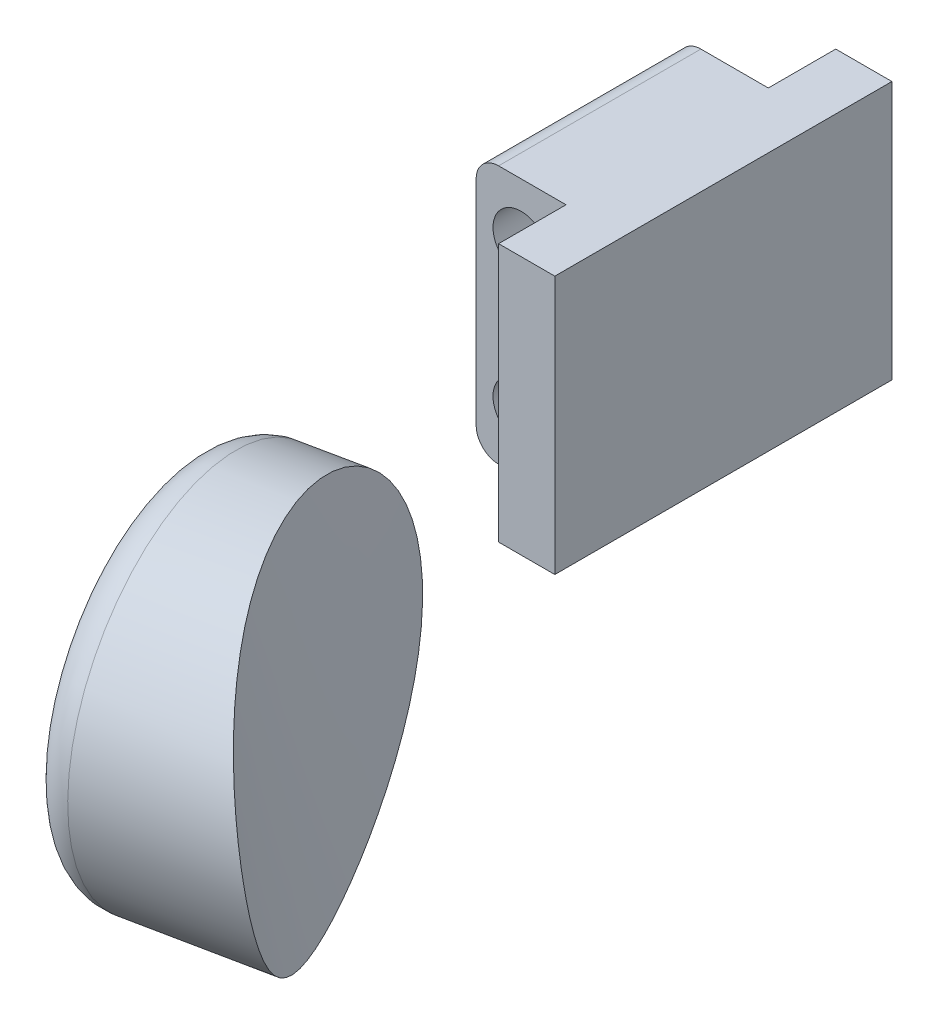
ISO-10303-21;
HEADER;
FILE_DESCRIPTION(('STEP AP214'),'2;1');
FILE_NAME('part.step','',(''),(''),'','','');
FILE_SCHEMA(('AUTOMOTIVE_DESIGN { 1 0 10303 214 1 1 1 1 }'));
ENDSEC;
DATA;
#1=APPLICATION_CONTEXT('core data for automotive mechanical design processes');
#2=APPLICATION_PROTOCOL_DEFINITION('international standard','automotive_design',2000,#1);
#3=PRODUCT_CONTEXT('',#1,'mechanical');
#4=PRODUCT('Part','Part','',(#3));
#5=PRODUCT_RELATED_PRODUCT_CATEGORY('part','',(#4));
#6=PRODUCT_DEFINITION_FORMATION('','',#4);
#7=PRODUCT_DEFINITION_CONTEXT('part definition',#1,'design');
#8=PRODUCT_DEFINITION('design','',#6,#7);
#9=PRODUCT_DEFINITION_SHAPE('','',#8);
#10=(LENGTH_UNIT() NAMED_UNIT(*) SI_UNIT(.MILLI.,.METRE.));
#11=(NAMED_UNIT(*) PLANE_ANGLE_UNIT() SI_UNIT($,.RADIAN.));
#12=(NAMED_UNIT(*) SI_UNIT($,.STERADIAN.) SOLID_ANGLE_UNIT());
#13=UNCERTAINTY_MEASURE_WITH_UNIT(LENGTH_MEASURE(1.E-05),#10,'distance_accuracy_value','');
#14=(GEOMETRIC_REPRESENTATION_CONTEXT(3) GLOBAL_UNCERTAINTY_ASSIGNED_CONTEXT((#13)) GLOBAL_UNIT_ASSIGNED_CONTEXT((#10,
#11,#12)) REPRESENTATION_CONTEXT('',''));
#15=CARTESIAN_POINT('',(0.,0.,0.));
#16=DIRECTION('',(0.,0.,1.));
#17=DIRECTION('',(1.,0.,0.));
#18=AXIS2_PLACEMENT_3D('',#15,#16,#17);
#19=CARTESIAN_POINT('',(47.9236738342779,0.,-110.329320506319));
#20=CARTESIAN_POINT('',(47.9236738342779,17.6991075048238,-110.329320506319));
#21=CARTESIAN_POINT('',(42.56332147204,34.8495537524119,-110.016211732728));
#22=CARTESIAN_POINT('',(37.202969109802,52.,-109.703102959137));
#23=CARTESIAN_POINT('',(48.4009958835601,0.,-111.031038484072));
#24=CARTESIAN_POINT('',(48.4009958835601,17.7056926320765,-111.031038484072));
#25=CARTESIAN_POINT('',(42.988769661527,34.8528463160383,-110.763685740666));
#26=CARTESIAN_POINT('',(37.5765434394938,52.,-110.496332997261));
#27=CARTESIAN_POINT('',(49.2975419279811,0.,-112.476546047765));
#28=CARTESIAN_POINT('',(49.2975419279811,17.7184400600976,-112.476546047765));
#29=CARTESIAN_POINT('',(43.7883921713864,34.8592200300488,-112.298305642809));
#30=CARTESIAN_POINT('',(38.2792424147916,52.,-112.120065237854));
#31=CARTESIAN_POINT('',(50.4692614141899,0.,-114.758087054483));
#32=CARTESIAN_POINT('',(50.4692614141899,17.7355814268284,-114.758087054483));
#33=CARTESIAN_POINT('',(44.8350102827149,34.8677907134142,-114.706065238378));
#34=CARTESIAN_POINT('',(39.20075915124,52.,-114.654043422274));
#35=CARTESIAN_POINT('',(51.4690759019835,0.,-117.139972558996));
#36=CARTESIAN_POINT('',(51.4690759019835,17.7505041490611,-117.139972558996));
#37=CARTESIAN_POINT('',(45.7298186944661,34.8752520745306,-117.206468659858));
#38=CARTESIAN_POINT('',(39.9905614869487,52.,-117.272964760719));
#39=CARTESIAN_POINT('',(56.4437003302975,0.,-131.955741592532));
#40=CARTESIAN_POINT('',(56.4437003302975,17.8284818993206,-131.955741592532));
#41=CARTESIAN_POINT('',(50.1938466908073,34.9142409496603,-132.685636645527));
#42=CARTESIAN_POINT('',(43.943993051317,52.,-133.415531698523));
#43=CARTESIAN_POINT('',(52.9769440445301,0.,-149.535584917485));
#44=CARTESIAN_POINT('',(52.9769440445301,17.7081403198643,-149.535584917485));
#45=CARTESIAN_POINT('',(47.1946128262273,34.8540701599321,-150.49695185142));
#46=CARTESIAN_POINT('',(41.4122816079244,52.,-151.458318785355));
#47=CARTESIAN_POINT('',(31.1969356532968,0.,-174.044597889101));
#48=CARTESIAN_POINT('',(31.1969356532968,17.4906090614254,-174.044597889101));
#49=CARTESIAN_POINT('',(28.0078512048271,34.7453045307127,-174.323574782565));
#50=CARTESIAN_POINT('',(24.8187667563575,52.,-174.602551676028));
#51=CARTESIAN_POINT('',(13.622767151366,0.,-173.705039048735));
#52=CARTESIAN_POINT('',(13.622767151366,17.395667899342,-173.705039048735));
#53=CARTESIAN_POINT('',(12.4456423177,34.697833949671,-172.933268426039));
#54=CARTESIAN_POINT('',(11.268517484034,52.,-172.161497803343));
#55=CARTESIAN_POINT('',(-5.47011481992174,0.,-145.636319938627));
#56=CARTESIAN_POINT('',(-5.47011481992174,17.3443852822835,-145.636319938627));
#57=CARTESIAN_POINT('',(-4.57228526177984,34.6721926411418,-143.034308108505));
#58=CARTESIAN_POINT('',(-3.67445570363794,52.,-140.432296278383));
#59=CARTESIAN_POINT('',(-3.39694497688932,0.,-123.187638746028));
#60=CARTESIAN_POINT('',(-3.39694497688932,17.3880438273085,-123.187638746028));
#61=CARTESIAN_POINT('',(-2.82647522860501,34.6940219136543,-120.150450696485));
#62=CARTESIAN_POINT('',(-2.25600548032069,52.,-117.113262646942));
#63=CARTESIAN_POINT('',(18.383063414344,0.,-98.6786257744115));
#64=CARTESIAN_POINT('',(18.383063414344,17.4695693050474,-98.6786257744115));
#65=CARTESIAN_POINT('',(16.3602863927951,34.7347846525237,-96.3238277653402));
#66=CARTESIAN_POINT('',(14.3375093712462,52.,-93.9690297562689));
#67=CARTESIAN_POINT('',(32.3904987881623,0.,-96.5947856718746));
#68=CARTESIAN_POINT('',(32.3904987881623,17.5091781505084,-96.5947856718746));
#69=CARTESIAN_POINT('',(28.7546714780627,34.7545890752542,-95.0189439220586));
#70=CARTESIAN_POINT('',(25.1188441679631,52.,-93.4431021722425));
#71=CARTESIAN_POINT('',(43.1464787762488,0.,-104.904803382329));
#72=CARTESIAN_POINT('',(43.1464787762488,17.6370277607948,-104.904803382329));
#73=CARTESIAN_POINT('',(38.3116952612447,34.8185138803974,-104.17349639431));
#74=CARTESIAN_POINT('',(33.4769117462406,52.,-103.442189406291));
#75=CARTESIAN_POINT('',(44.8491054504042,0.,-106.495815316789));
#76=CARTESIAN_POINT('',(44.8491054504042,17.6580610456385,-106.495815316789));
#77=CARTESIAN_POINT('',(39.8256352014193,34.8290305228193,-105.90504607363));
#78=CARTESIAN_POINT('',(34.8021649524344,52.,-105.314276830471));
#79=CARTESIAN_POINT('',(46.4515690488499,0.,-108.292640576634));
#80=CARTESIAN_POINT('',(46.4515690488499,17.6789292965815,-108.292640576634));
#81=CARTESIAN_POINT('',(41.2517106780921,34.8394646482907,-107.841585577924));
#82=CARTESIAN_POINT('',(36.0518523073342,52.,-107.390530579214));
#83=CARTESIAN_POINT('',(47.4463517849958,0.,-109.627602528566));
#84=CARTESIAN_POINT('',(47.4463517849958,17.6925223775711,-109.627602528566));
#85=CARTESIAN_POINT('',(42.137873282553,34.8462611887856,-109.26873772479));
#86=CARTESIAN_POINT('',(36.8293947801102,52.,-108.909872921013));
#87=CARTESIAN_POINT('',(47.9236738342779,0.,-110.329320506319));
#88=CARTESIAN_POINT('',(47.9236738342779,17.6991075048238,-110.329320506319));
#89=CARTESIAN_POINT('',(42.56332147204,34.8495537524119,-110.016211732728));
#90=CARTESIAN_POINT('',(37.202969109802,52.,-109.703102959137));
#91=B_SPLINE_SURFACE_WITH_KNOTS('',3,3,((#19,#20,#21,#22),(#23,#24,#25,#26),(#27,#28,#29,#30),
(#31,#32,#33,#34),(#35,#36,#37,#38),(#39,#40,#41,#42),(#43,#44,#45,#46),(#47,#48,#49,#50),(#51,
#52,#53,#54),(#55,#56,#57,#58),(#59,#60,#61,#62),(#63,#64,#65,#66),(#67,#68,#69,#70),(#71,#72,
#73,#74),(#75,#76,#77,#78),(#79,#80,#81,#82),(#83,#84,#85,#86),(#87,#88,#89,#90)),.UNSPECIFIED.,
.T.,.F.,.F.,(4,1,1,1,1,2,2,2,1,1,1,1,4),(4,4),(0.,0.0125,0.0249999999999999,0.0375000000000001,
0.05,0.25,0.5,0.75,0.95,0.9625,0.975,0.9875,1.),(0.,1.),.UNSPECIFIED.);
#92=CARTESIAN_POINT('',(7.21185150487884,40.9148197263255,-106.328511216655));
#93=CARTESIAN_POINT('',(7.18159766582376,41.1394840780572,-106.322098490295));
#94=CARTESIAN_POINT('',(7.14521295501741,41.3635358712388,-106.324049374362));
#95=CARTESIAN_POINT('',(7.06108371256741,41.8088194014787,-106.344451702724));
#96=CARTESIAN_POINT('',(7.01333476968595,42.0300500082197,-106.362909562198));
#97=CARTESIAN_POINT('',(6.90748604572067,42.4683671042778,-106.416032103339));
#98=CARTESIAN_POINT('',(6.84937141265366,42.6854471458817,-106.450720156975));
#99=CARTESIAN_POINT('',(6.72398291802274,43.1138682639204,-106.535911282031));
#100=CARTESIAN_POINT('',(6.65670519493354,43.3252068755108,-106.586421032785));
#101=CARTESIAN_POINT('',(6.51457468099788,43.7398030905078,-106.702499273606));
#102=CARTESIAN_POINT('',(6.43976177426315,43.9430960515556,-106.767990590618));
#103=CARTESIAN_POINT('',(6.28343422524179,44.3417363017902,-106.913727722762));
#104=CARTESIAN_POINT('',(6.2019173071237,44.5370808587889,-106.993978559879));
#105=CARTESIAN_POINT('',(6.03338505635752,44.9187091982539,-107.168708639347));
#106=CARTESIAN_POINT('',(5.94637201007548,45.1049966920853,-107.263181987527));
#107=CARTESIAN_POINT('',(5.76791234831125,45.4676951838759,-107.465899291758));
#108=CARTESIAN_POINT('',(5.67646555923655,45.6441057945458,-107.574143787256));
#109=CARTESIAN_POINT('',(5.4835589292109,45.9983294244821,-107.812070994307));
#110=CARTESIAN_POINT('',(5.38184929395204,46.1753515439442,-107.942730462337));
#111=CARTESIAN_POINT('',(5.17578395103564,46.5159287486816,-108.218567549995));
#112=CARTESIAN_POINT('',(5.07142904790165,46.6794878657749,-108.363740794071));
#113=CARTESIAN_POINT('',(4.86111700110517,46.9922197815614,-108.667994735137));
#114=CARTESIAN_POINT('',(4.75515898295474,47.1413843748863,-108.827083266966));
#115=CARTESIAN_POINT('',(4.54280818540879,47.4240845699208,-109.158192854924));
#116=CARTESIAN_POINT('',(4.43641559385283,47.5576263091442,-109.330208788546));
#117=CARTESIAN_POINT('',(4.22238233280157,47.8101586541145,-109.689224111277));
#118=CARTESIAN_POINT('',(4.11475031697206,47.928870462082,-109.876425044792));
#119=CARTESIAN_POINT('',(3.90098909589054,48.148000127717,-110.262071861389));
#120=CARTESIAN_POINT('',(3.79485992127357,48.2484176129532,-110.46051797329));
#121=CARTESIAN_POINT('',(3.58501712411785,48.4298924350363,-110.867238392324));
#122=CARTESIAN_POINT('',(3.481302964922,48.5109541108476,-111.075510484221));
#123=CARTESIAN_POINT('',(3.27706709399762,48.6527976570626,-111.50036013317));
#124=CARTESIAN_POINT('',(3.1765452201647,48.713580558718,-111.716937267255));
#125=CARTESIAN_POINT('',(2.98396106021225,48.8117362744746,-112.146467054879));
#126=CARTESIAN_POINT('',(2.89172259207167,48.8500628674693,-112.359123070613));
#127=CARTESIAN_POINT('',(2.71130389115271,48.9069923795967,-112.788755543091));
#128=CARTESIAN_POINT('',(2.6231235490554,48.9255958303348,-113.005731883227));
#129=CARTESIAN_POINT('',(2.45126898590752,48.942696977062,-113.442198450711));
#130=CARTESIAN_POINT('',(2.36759386286284,48.9411987127754,-113.661688164103));
#131=CARTESIAN_POINT('',(2.20507159021938,48.9179135415687,-114.101377415488));
#132=CARTESIAN_POINT('',(2.1262243086515,48.8961271894877,-114.321576933905));
#133=CARTESIAN_POINT('',(1.97690118302046,48.8336530053845,-114.751315949565));
#134=CARTESIAN_POINT('',(1.9062109817459,48.7938205056688,-114.960905765588));
#135=CARTESIAN_POINT('',(1.7696287461449,48.6957667538057,-115.377331606102));
#136=CARTESIAN_POINT('',(1.70373668683436,48.6375455974172,-115.584167644927));
#137=CARTESIAN_POINT('',(1.57684339864153,48.5030637169281,-115.993408129456));
#138=CARTESIAN_POINT('',(1.51584179675335,48.4268043703958,-116.195812912283));
#139=CARTESIAN_POINT('',(1.39875586042136,48.2567447574413,-116.594586391871));
#140=CARTESIAN_POINT('',(1.34267152963564,48.16294447797,-116.790955084142));
#141=CARTESIAN_POINT('',(1.23608971435459,47.9597512241216,-117.173644150685));
#142=CARTESIAN_POINT('',(1.18553039016869,47.8505711149656,-117.360060384291));
#143=CARTESIAN_POINT('',(1.08913368376861,47.616460501666,-117.724106364385));
#144=CARTESIAN_POINT('',(1.04329791925988,47.4915246339145,-117.901733089922));
#145=CARTESIAN_POINT('',(0.956310047746273,47.226827951886,-118.246743424654));
#146=CARTESIAN_POINT('',(0.915157145042318,47.0870696640148,-118.414128771796));
#147=CARTESIAN_POINT('',(0.837447059716074,46.7936870843228,-118.737426345348));
#148=CARTESIAN_POINT('',(0.800889980885949,46.6400624794795,-118.893338312611));
#149=CARTESIAN_POINT('',(0.732112327912179,46.3191908611478,-119.193297161638));
#150=CARTESIAN_POINT('',(0.699915341610082,46.1518770389412,-119.337277987515));
#151=CARTESIAN_POINT('',(0.640005535256855,45.80550463843,-119.611385875167));
#152=CARTESIAN_POINT('',(0.612292825765799,45.6264457707037,-119.741512595341));
#153=CARTESIAN_POINT('',(0.561291004219272,45.2578751790944,-119.986922920323));
#154=CARTESIAN_POINT('',(0.538001204692819,45.0683650856068,-120.102208831001));
#155=CARTESIAN_POINT('',(0.495785694403577,44.680129112155,-120.31715039575));
#156=CARTESIAN_POINT('',(0.476861497510898,44.4814000639196,-120.416800623981));
#157=CARTESIAN_POINT('',(0.44326067531788,44.0749282268681,-120.600261490692));
#158=CARTESIAN_POINT('',(0.428610958208635,43.8671374175906,-120.683970680555));
#159=CARTESIAN_POINT('',(0.403719832848324,43.4451630271007,-120.834175012278));
#160=CARTESIAN_POINT('',(0.393478533918747,43.2309792874951,-120.900669727231));
#161=CARTESIAN_POINT('',(0.377438684848652,42.7977387858472,-121.01596899963));
#162=CARTESIAN_POINT('',(0.371640146503185,42.5786820108692,-121.06477351011));
#163=CARTESIAN_POINT('',(0.364550809362959,42.1372464832141,-121.144356779448));
#164=CARTESIAN_POINT('',(0.363260012925605,41.9148677287999,-121.175135528879));
#165=CARTESIAN_POINT('',(0.365283922777813,41.4677925158672,-121.218528392349));
#166=CARTESIAN_POINT('',(0.368610387006718,41.2430915918064,-121.231095964525));
#167=CARTESIAN_POINT('',(0.380013681269523,40.7935383964289,-121.237866491806));
#168=CARTESIAN_POINT('',(0.388090414782893,40.5686861282801,-121.232069820043));
#169=CARTESIAN_POINT('',(0.409144342498229,40.1203862046992,-121.202203685192));
#170=CARTESIAN_POINT('',(0.422122463605,39.896938823077,-121.178130765));
#171=CARTESIAN_POINT('',(0.453140354368962,39.4531646330737,-121.11195853321));
#172=CARTESIAN_POINT('',(0.471178371939654,39.2328367721911,-121.069865458787));
#173=CARTESIAN_POINT('',(0.512507644406426,38.7966702188892,-120.96800682724));
#174=CARTESIAN_POINT('',(0.535801958554398,38.5808342210326,-120.908230972117));
#175=CARTESIAN_POINT('',(0.587817542149199,38.1553358006892,-120.771542871778));
#176=CARTESIAN_POINT('',(0.616538687187694,37.9456732368057,-120.694631019392));
#177=CARTESIAN_POINT('',(0.679580734117951,37.5340196632984,-120.524334348715));
#178=CARTESIAN_POINT('',(0.713901644894774,37.3320286658476,-120.430949504286));
#179=CARTESIAN_POINT('',(0.788295919964925,36.9371696489458,-120.228507582912));
#180=CARTESIAN_POINT('',(0.828369184469298,36.7443014713139,-120.119450777837));
#181=CARTESIAN_POINT('',(0.914345209538068,36.3692626963408,-119.886715374541));
#182=CARTESIAN_POINT('',(0.960241715304225,36.1870809232101,-119.763052474568));
#183=CARTESIAN_POINT('',(1.05795889836239,35.8345483359039,-119.502104922992));
#184=CARTESIAN_POINT('',(1.10977738297771,35.6641931801095,-119.364825315592));
#185=CARTESIAN_POINT('',(1.21938544408859,35.3364078932229,-119.077737928872));
#186=CARTESIAN_POINT('',(1.27717589120818,35.1789796527048,-118.92792832347));
#187=CARTESIAN_POINT('',(1.39868250082053,34.8781565063673,-118.617047224767));
#188=CARTESIAN_POINT('',(1.46239866444907,34.7347616032377,-118.455975729307));
#189=CARTESIAN_POINT('',(1.59564013257972,34.4629701677062,-118.123910399756));
#190=CARTESIAN_POINT('',(1.66516504353947,34.3345726206454,-117.952917238097));
#191=CARTESIAN_POINT('',(1.80983634248144,34.0935849146329,-117.602387082178));
#192=CARTESIAN_POINT('',(1.8849827182199,33.9809947212539,-117.422850106527));
#193=CARTESIAN_POINT('',(2.04062427620696,33.7722967029369,-117.056655719395));
#194=CARTESIAN_POINT('',(2.12111953026495,33.6761890993419,-116.869998212334));
#195=CARTESIAN_POINT('',(2.28710087385352,33.5009875772022,-116.491006120471));
#196=CARTESIAN_POINT('',(2.37258701461614,33.4218938333459,-116.298671477403));
#197=CARTESIAN_POINT('',(2.54915204773214,33.2802708536861,-115.907454067515));
#198=CARTESIAN_POINT('',(2.64028523630396,33.2179491497833,-115.708520698883));
#199=CARTESIAN_POINT('',(2.82667500846588,33.1113750697448,-115.307771309929));
#200=CARTESIAN_POINT('',(2.92193161412244,33.0671227903208,-115.105955274185));
#201=CARTESIAN_POINT('',(3.11594947893285,32.996809357844,-114.700864485605));
#202=CARTESIAN_POINT('',(3.21471052433064,32.9707470972741,-114.497589822342));
#203=CARTESIAN_POINT('',(3.41509632433433,32.9368028001907,-114.09084511517));
#204=CARTESIAN_POINT('',(3.5167221470888,32.9289276380763,-113.887375026456));
#205=CARTESIAN_POINT('',(3.72517891314839,32.9313115083724,-113.475421523301));
#206=CARTESIAN_POINT('',(3.83207416472888,32.9421292675786,-113.266973809644));
#207=CARTESIAN_POINT('',(4.04722728436911,32.9827826357574,-112.852557548362));
#208=CARTESIAN_POINT('',(4.15548565267567,33.0126254386264,-112.646589968573));
#209=CARTESIAN_POINT('',(4.37235544487943,33.0910453077315,-112.238492161327));
#210=CARTESIAN_POINT('',(4.48096680234064,33.1396190305682,-112.036361255789));
#211=CARTESIAN_POINT('',(4.69759647706621,33.2551828914548,-111.636981175655));
#212=CARTESIAN_POINT('',(4.8056144933393,33.3221816287557,-111.439734327497));
#213=CARTESIAN_POINT('',(5.02337325450148,33.4766352399003,-111.045091853433));
#214=CARTESIAN_POINT('',(5.13305784820619,33.5646781777441,-110.847895052023));
#215=CARTESIAN_POINT('',(5.34927971836335,33.7594181740893,-110.461271735466));
#216=CARTESIAN_POINT('',(5.45581840103031,33.8661067458403,-110.271841733403));
#217=CARTESIAN_POINT('',(5.66452886590557,34.0976855901289,-109.9017039787));
#218=CARTESIAN_POINT('',(5.76669795071868,34.2225869016626,-109.721001605059));
#219=CARTESIAN_POINT('',(5.96514223252067,34.4898497123346,-109.369684581636));
#220=CARTESIAN_POINT('',(6.06142006876923,34.6322033057757,-109.199065415799));
#221=CARTESIAN_POINT('',(6.2455987516046,34.9319489751553,-108.870886582919));
#222=CARTESIAN_POINT('',(6.33358255610193,35.0891511934607,-108.713200252053));
#223=CARTESIAN_POINT('',(6.50088752592488,35.4189836006071,-108.409985151946));
#224=CARTESIAN_POINT('',(6.58021287572383,35.5916062630211,-108.264450518077));
#225=CARTESIAN_POINT('',(6.72876892741933,35.9512475259911,-107.986655230325));
#226=CARTESIAN_POINT('',(6.79800117804144,36.1382639111734,-107.854392540914));
#227=CARTESIAN_POINT('',(6.92496599662875,36.5253920374807,-107.604303422068));
#228=CARTESIAN_POINT('',(6.9826998938146,36.7255022613881,-107.486475324586));
#229=CARTESIAN_POINT('',(7.08129573168589,37.1207864944401,-107.275170428673));
#230=CARTESIAN_POINT('',(7.12313658547036,37.3150794590382,-107.180500598313));
#231=CARTESIAN_POINT('',(7.19518333707148,37.7119719899689,-107.005139153173));
#232=CARTESIAN_POINT('',(7.22538911109765,37.9145716446545,-106.924447687119));
#233=CARTESIAN_POINT('',(7.27352410684618,38.3261494382737,-106.777850940869));
#234=CARTESIAN_POINT('',(7.29147056607992,38.5351181878105,-106.711924987351));
#235=CARTESIAN_POINT('',(7.31482593423322,38.9578610702565,-106.595278316572));
#236=CARTESIAN_POINT('',(7.32023880873059,39.1716336616282,-106.544552794378));
#237=CARTESIAN_POINT('',(7.31835380374367,39.639356030668,-106.451240046214));
#238=CARTESIAN_POINT('',(7.30870582357344,39.8938835149327,-106.411559799443));
#239=CARTESIAN_POINT('',(7.27261932911826,40.4041436074769,-106.353835184438));
#240=CARTESIAN_POINT('',(7.24618282784551,40.6598760676264,-106.335788223033));
#241=CARTESIAN_POINT('',(7.21185150487884,40.9148197263255,-106.328511216655));
#242=B_SPLINE_CURVE_WITH_KNOTS('',3,(#92,#93,#94,#95,#96,#97,#98,#99,#100,#101,#102,#103,#104,
#105,#106,#107,#108,#109,#110,#111,#112,#113,#114,#115,#116,#117,#118,#119,#120,#121,#122,#123,
#124,#125,#126,#127,#128,#129,#130,#131,#132,#133,#134,#135,#136,#137,#138,#139,#140,#141,#142,
#143,#144,#145,#146,#147,#148,#149,#150,#151,#152,#153,#154,#155,#156,#157,#158,#159,#160,#161,
#162,#163,#164,#165,#166,#167,#168,#169,#170,#171,#172,#173,#174,#175,#176,#177,#178,#179,#180,
#181,#182,#183,#184,#185,#186,#187,#188,#189,#190,#191,#192,#193,#194,#195,#196,#197,#198,#199,
#200,#201,#202,#203,#204,#205,#206,#207,#208,#209,#210,#211,#212,#213,#214,#215,#216,#217,#218,
#219,#220,#221,#222,#223,#224,#225,#226,#227,#228,#229,#230,#231,#232,#233,#234,#235,#236,#237,
#238,#239,#240,#241),.UNSPECIFIED.,.T.,.F.,(4,2,2,2,2,2,2,2,2,2,2,2,2,2,2,2,2,2,2,2,2,2,2,2,2,2,
2,2,2,2,2,2,2,2,2,2,2,2,2,2,2,2,2,2,2,2,2,2,2,2,2,2,2,2,2,2,2,2,2,2,2,2,2,2,2,2,2,2,2,2,2,2,2,2,
4),(0.,0.680081509987419,1.36042743804143,2.04175611442413,2.72337281110228,3.40155442321443,
4.07996721765078,4.75809963055636,5.43625861557932,6.16260085638578,6.88872477919261,
7.61526020214941,8.34150923680559,9.07983122476976,9.81816824163459,10.5563395908276,
11.2944733955123,11.9984236537816,12.7023549377307,13.4061447588345,14.1099153332382,
14.7833463521235,15.4567738641762,16.1301499634738,16.8035265637089,17.4683621852243,
18.1334247454995,18.7983741308835,19.4633385307992,20.1317677255223,20.8002133978913,
21.4685550858247,22.1371281889265,22.8098234414985,23.4825353748407,24.1552490941545,
24.8279631652758,25.5023934615424,26.1768100545603,26.8513542508832,27.5256651610172,
28.2003695482385,28.8750584699572,29.5497484622045,30.2244267516813,30.8983864023757,
31.5720973157966,32.2459065852609,32.9197159838743,33.5934797688943,34.2672420864738,
34.9410134512265,35.6147917335373,36.2965592556635,36.9783304267196,37.6600600838539,
38.3420473805057,39.0447732968174,39.7477650910147,40.450631461834,41.1538264300606,
41.8796139032597,42.6050718831803,43.3309714152708,44.0565433292518,44.7738469513707,
45.4908023643369,46.2076476487403,46.9244100169827,47.5839576407809,48.2435122815888,
48.9021376198552,49.5605545431173,50.3323870784826,51.1041270854461),.UNSPECIFIED.);
#243=CARTESIAN_POINT('',(7.21185150487884,40.9148197263255,-106.328511216655));
#244=VERTEX_POINT('',#243);
#245=EDGE_CURVE('E145',#244,#244,#242,.T.);
#246=ORIENTED_EDGE('',*,*,#245,.F.);
#247=EDGE_LOOP('',(#246));
#248=FACE_BOUND('',#247,.T.);
#249=ADVANCED_FACE('F132',(#248),#91,.F.);
#250=CARTESIAN_POINT('',(7.50272461152403,40.8994944366577,-114.567812983087));
#251=DIRECTION('',(-0.978245900657005,0.00769063621354921,0.207306082791594));
#252=DIRECTION('',(0.207312213714464,0.,0.978274831550321));
#253=AXIS2_PLACEMENT_3D('',#250,#251,#252);
#254=CYLINDRICAL_SURFACE('',#253,8.);
#255=CARTESIAN_POINT('',(-0.812365544060512,40.9648648444729,-112.805711279358));
#256=DIRECTION('',(-0.978245900657005,0.00769063621354921,0.207306082791594));
#257=DIRECTION('',(0.207312213714464,0.,0.978274831550321));
#258=AXIS2_PLACEMENT_3D('',#255,#256,#257);
#259=CIRCLE('',#258,8.);
#260=CARTESIAN_POINT('',(0.846132165655201,40.9648648444729,-104.979512626956));
#261=VERTEX_POINT('',#260);
#262=EDGE_CURVE('E12',#261,#261,#259,.F.);
#263=ORIENTED_EDGE('',*,*,#262,.T.);
#264=EDGE_LOOP('',(#263));
#265=FACE_BOUND('',#264,.T.);
#266=ORIENTED_EDGE('',*,*,#245,.T.);
#267=EDGE_LOOP('',(#266));
#268=FACE_BOUND('',#267,.T.);
#269=ADVANCED_FACE('F159',(#265,#268),#254,.T.);
#270=CARTESIAN_POINT('',(-2.27973439504602,40.9764007987932,-112.494752155171));
#271=DIRECTION('',(-0.978245900657005,0.00769063621354921,0.207306082791594));
#272=DIRECTION('',(0.207312213714464,0.,0.978274831550321));
#273=AXIS2_PLACEMENT_3D('',#270,#271,#272);
#274=PLANE('',#273);
#275=CARTESIAN_POINT('',(-2.27973439504602,40.9764007987932,-112.494752155171));
#276=DIRECTION('',(-0.978245900657005,0.00769063621354921,0.207306082791594));
#277=DIRECTION('',(0.207312213714464,0.,0.978274831550321));
#278=AXIS2_PLACEMENT_3D('',#275,#276,#277);
#279=CIRCLE('',#278,6.5);
#280=CARTESIAN_POINT('',(-0.932205005902006,40.9764007987932,-106.135965750094));
#281=VERTEX_POINT('',#280);
#282=EDGE_CURVE('E140',#281,#281,#279,.T.);
#283=ORIENTED_EDGE('',*,*,#282,.T.);
#284=EDGE_LOOP('',(#283));
#285=FACE_BOUND('',#284,.T.);
#286=ADVANCED_FACE('F162',(#285),#274,.T.);
#287=CARTESIAN_POINT('',(-0.812365544060513,40.9648648444729,-112.805711279358));
#288=DIRECTION('',(-0.978245900657005,0.00769063621354921,0.207306082791594));
#289=DIRECTION('',(0.207312213714464,0.,0.978274831550321));
#290=AXIS2_PLACEMENT_3D('',#287,#288,#289);
#291=TOROIDAL_SURFACE('',#290,6.5,1.5);
#292=ORIENTED_EDGE('',*,*,#262,.F.);
#293=EDGE_LOOP('',(#292));
#294=FACE_BOUND('',#293,.T.);
#295=ORIENTED_EDGE('',*,*,#282,.F.);
#296=EDGE_LOOP('',(#295));
#297=FACE_BOUND('',#296,.T.);
#298=ADVANCED_FACE('F134',(#294,#297),#291,.T.);
#299=CLOSED_SHELL('',(#249,#269,#286,#298));
#300=MANIFOLD_SOLID_BREP('B2',#299);
#301=CARTESIAN_POINT('',(-2.5,0.,0.));
#302=DIRECTION('',(-1.,0.,0.));
#303=DIRECTION('',(0.,0.,1.));
#304=AXIS2_PLACEMENT_3D('',#301,#302,#303);
#305=PLANE('',#304);
#306=DIRECTION('',(0.,0.,1.));
#307=VECTOR('',#306,1.);
#308=CARTESIAN_POINT('',(-2.5,49.5,-142.5));
#309=LINE('',#308,#307);
#310=CARTESIAN_POINT('',(-2.5,49.5,-130.5));
#311=VERTEX_POINT('',#310);
#312=CARTESIAN_POINT('',(-2.5,49.5,-127.5));
#313=VERTEX_POINT('',#312);
#314=EDGE_CURVE('E316',#311,#313,#309,.T.);
#315=ORIENTED_EDGE('',*,*,#314,.F.);
#316=DIRECTION('',(0.,-1.,0.));
#317=VECTOR('',#316,1.);
#318=CARTESIAN_POINT('',(-2.5,49.5,-130.5));
#319=LINE('',#318,#317);
#320=CARTESIAN_POINT('',(-2.5,38.,-130.5));
#321=VERTEX_POINT('',#320);
#322=EDGE_CURVE('E300',#311,#321,#319,.T.);
#323=ORIENTED_EDGE('',*,*,#322,.T.);
#324=DIRECTION('',(0.,0.,-1.));
#325=VECTOR('',#324,1.);
#326=CARTESIAN_POINT('',(-2.5,38.,-142.5));
#327=LINE('',#326,#325);
#328=CARTESIAN_POINT('',(-2.5,38.,-127.5));
#329=VERTEX_POINT('',#328);
#330=EDGE_CURVE('E294',#329,#321,#327,.T.);
#331=ORIENTED_EDGE('',*,*,#330,.F.);
#332=DIRECTION('',(0.,-1.,0.));
#333=VECTOR('',#332,1.);
#334=CARTESIAN_POINT('',(-2.5,49.5,-127.5));
#335=LINE('',#334,#333);
#336=EDGE_CURVE('E295',#313,#329,#335,.T.);
#337=ORIENTED_EDGE('',*,*,#336,.F.);
#338=EDGE_LOOP('',(#315,#323,#331,#337));
#339=FACE_BOUND('',#338,.T.);
#340=ADVANCED_FACE('F202',(#339),#305,.T.);
#341=CARTESIAN_POINT('',(-2.5,49.5,-142.5));
#342=DIRECTION('',(0.,0.,-1.));
#343=DIRECTION('',(-1.,0.,0.));
#344=AXIS2_PLACEMENT_3D('',#341,#342,#343);
#345=PLANE('',#344);
#346=DIRECTION('',(0.,1.,0.));
#347=VECTOR('',#346,1.);
#348=CARTESIAN_POINT('',(0.,49.5,-142.5));
#349=LINE('',#348,#347);
#350=CARTESIAN_POINT('',(0.,38.,-142.5));
#351=VERTEX_POINT('',#350);
#352=CARTESIAN_POINT('',(0.,49.5,-142.5));
#353=VERTEX_POINT('',#352);
#354=EDGE_CURVE('E310',#351,#353,#349,.T.);
#355=ORIENTED_EDGE('',*,*,#354,.F.);
#356=DIRECTION('',(1.,0.,0.));
#357=VECTOR('',#356,1.);
#358=CARTESIAN_POINT('',(-2.5,38.,-142.5));
#359=LINE('',#358,#357);
#360=CARTESIAN_POINT('',(-2.5,38.,-142.5));
#361=VERTEX_POINT('',#360);
#362=EDGE_CURVE('E334',#361,#351,#359,.T.);
#363=ORIENTED_EDGE('',*,*,#362,.F.);
#364=DIRECTION('',(0.,1.,0.));
#365=VECTOR('',#364,1.);
#366=CARTESIAN_POINT('',(-2.5,49.5,-142.5));
#367=LINE('',#366,#365);
#368=CARTESIAN_POINT('',(-2.5,49.5,-142.5));
#369=VERTEX_POINT('',#368);
#370=EDGE_CURVE('E293',#361,#369,#367,.T.);
#371=ORIENTED_EDGE('',*,*,#370,.T.);
#372=DIRECTION('',(1.,0.,0.));
#373=VECTOR('',#372,1.);
#374=CARTESIAN_POINT('',(-2.5,49.5,-142.5));
#375=LINE('',#374,#373);
#376=EDGE_CURVE('E323',#369,#353,#375,.T.);
#377=ORIENTED_EDGE('',*,*,#376,.T.);
#378=EDGE_LOOP('',(#355,#363,#371,#377));
#379=FACE_BOUND('',#378,.T.);
#380=ADVANCED_FACE('F389',(#379),#345,.T.);
#381=CARTESIAN_POINT('',(-2.5,38.,-142.5));
#382=DIRECTION('',(0.,-1.,0.));
#383=DIRECTION('',(0.,0.,-1.));
#384=AXIS2_PLACEMENT_3D('',#381,#382,#383);
#385=PLANE('',#384);
#386=DIRECTION('',(1.,0.,0.));
#387=VECTOR('',#386,1.);
#388=CARTESIAN_POINT('',(-6.5,38.,-130.5));
#389=LINE('',#388,#387);
#390=CARTESIAN_POINT('',(-5.5,38.,-130.5));
#391=VERTEX_POINT('',#390);
#392=EDGE_CURVE('E283',#391,#321,#389,.T.);
#393=ORIENTED_EDGE('',*,*,#392,.F.);
#394=DIRECTION('',(0.,0.,1.));
#395=VECTOR('',#394,1.);
#396=CARTESIAN_POINT('',(-5.5,38.,-139.5));
#397=LINE('',#396,#395);
#398=CARTESIAN_POINT('',(-5.5,38.,-139.5));
#399=VERTEX_POINT('',#398);
#400=EDGE_CURVE('E130',#391,#399,#397,.F.);
#401=ORIENTED_EDGE('',*,*,#400,.T.);
#402=DIRECTION('',(1.,0.,0.));
#403=VECTOR('',#402,1.);
#404=CARTESIAN_POINT('',(-6.5,38.,-139.5));
#405=LINE('',#404,#403);
#406=CARTESIAN_POINT('',(-2.5,38.,-139.5));
#407=VERTEX_POINT('',#406);
#408=EDGE_CURVE('E276',#399,#407,#405,.T.);
#409=ORIENTED_EDGE('',*,*,#408,.T.);
#410=EDGE_CURVE('E279',#407,#361,#327,.T.);
#411=ORIENTED_EDGE('',*,*,#410,.T.);
#412=ORIENTED_EDGE('',*,*,#362,.T.);
#413=DIRECTION('',(0.,0.,-1.));
#414=VECTOR('',#413,1.);
#415=CARTESIAN_POINT('',(0.,38.,-142.5));
#416=LINE('',#415,#414);
#417=CARTESIAN_POINT('',(0.,38.,-127.5));
#418=VERTEX_POINT('',#417);
#419=EDGE_CURVE('E317',#418,#351,#416,.T.);
#420=ORIENTED_EDGE('',*,*,#419,.F.);
#421=DIRECTION('',(1.,0.,0.));
#422=VECTOR('',#421,1.);
#423=CARTESIAN_POINT('',(-2.5,38.,-127.5));
#424=LINE('',#423,#422);
#425=EDGE_CURVE('E337',#329,#418,#424,.T.);
#426=ORIENTED_EDGE('',*,*,#425,.F.);
#427=ORIENTED_EDGE('',*,*,#330,.T.);
#428=EDGE_LOOP('',(#393,#401,#409,#411,#412,#420,#426,#427));
#429=FACE_BOUND('',#428,.T.);
#430=ADVANCED_FACE('F278',(#429),#385,.T.);
#431=CARTESIAN_POINT('',(-2.5,49.5,-127.5));
#432=DIRECTION('',(0.,0.,1.));
#433=DIRECTION('',(1.,0.,0.));
#434=AXIS2_PLACEMENT_3D('',#431,#432,#433);
#435=PLANE('',#434);
#436=DIRECTION('',(0.,-1.,0.));
#437=VECTOR('',#436,1.);
#438=CARTESIAN_POINT('',(0.,49.5,-127.5));
#439=LINE('',#438,#437);
#440=CARTESIAN_POINT('',(0.,49.5,-127.5));
#441=VERTEX_POINT('',#440);
#442=EDGE_CURVE('E329',#441,#418,#439,.T.);
#443=ORIENTED_EDGE('',*,*,#442,.F.);
#444=DIRECTION('',(1.,0.,0.));
#445=VECTOR('',#444,1.);
#446=CARTESIAN_POINT('',(-2.5,49.5,-127.5));
#447=LINE('',#446,#445);
#448=EDGE_CURVE('E339',#313,#441,#447,.T.);
#449=ORIENTED_EDGE('',*,*,#448,.F.);
#450=ORIENTED_EDGE('',*,*,#336,.T.);
#451=ORIENTED_EDGE('',*,*,#425,.T.);
#452=EDGE_LOOP('',(#443,#449,#450,#451));
#453=FACE_BOUND('',#452,.T.);
#454=ADVANCED_FACE('F384',(#453),#435,.T.);
#455=CARTESIAN_POINT('',(-2.5,49.5,-142.5));
#456=DIRECTION('',(0.,1.,0.));
#457=DIRECTION('',(0.,0.,1.));
#458=AXIS2_PLACEMENT_3D('',#455,#456,#457);
#459=PLANE('',#458);
#460=DIRECTION('',(1.,0.,0.));
#461=VECTOR('',#460,1.);
#462=CARTESIAN_POINT('',(-6.5,49.5,-139.5));
#463=LINE('',#462,#461);
#464=CARTESIAN_POINT('',(-5.5,49.5,-139.5));
#465=VERTEX_POINT('',#464);
#466=CARTESIAN_POINT('',(-2.5,49.5,-139.5));
#467=VERTEX_POINT('',#466);
#468=EDGE_CURVE('E282',#465,#467,#463,.T.);
#469=ORIENTED_EDGE('',*,*,#468,.F.);
#470=DIRECTION('',(0.,0.,1.));
#471=VECTOR('',#470,1.);
#472=CARTESIAN_POINT('',(-5.5,49.5,-130.5));
#473=LINE('',#472,#471);
#474=CARTESIAN_POINT('',(-5.5,49.5,-130.5));
#475=VERTEX_POINT('',#474);
#476=EDGE_CURVE('E336',#465,#475,#473,.T.);
#477=ORIENTED_EDGE('',*,*,#476,.T.);
#478=DIRECTION('',(1.,0.,0.));
#479=VECTOR('',#478,1.);
#480=CARTESIAN_POINT('',(-6.5,49.5,-130.5));
#481=LINE('',#480,#479);
#482=EDGE_CURVE('E313',#475,#311,#481,.T.);
#483=ORIENTED_EDGE('',*,*,#482,.T.);
#484=ORIENTED_EDGE('',*,*,#314,.T.);
#485=ORIENTED_EDGE('',*,*,#448,.T.);
#486=DIRECTION('',(0.,0.,1.));
#487=VECTOR('',#486,1.);
#488=CARTESIAN_POINT('',(0.,49.5,-142.5));
#489=LINE('',#488,#487);
#490=EDGE_CURVE('E326',#353,#441,#489,.T.);
#491=ORIENTED_EDGE('',*,*,#490,.F.);
#492=ORIENTED_EDGE('',*,*,#376,.F.);
#493=EDGE_CURVE('E318',#369,#467,#309,.T.);
#494=ORIENTED_EDGE('',*,*,#493,.T.);
#495=EDGE_LOOP('',(#469,#477,#483,#484,#485,#491,#492,#494));
#496=FACE_BOUND('',#495,.T.);
#497=ADVANCED_FACE('F364',(#496),#459,.T.);
#498=DIRECTION('',(0.,-1.,0.));
#499=VECTOR('',#498,1.);
#500=CARTESIAN_POINT('',(-2.5,49.5,-139.5));
#501=LINE('',#500,#499);
#502=EDGE_CURVE('E290',#467,#407,#501,.T.);
#503=ORIENTED_EDGE('',*,*,#502,.F.);
#504=ORIENTED_EDGE('',*,*,#493,.F.);
#505=ORIENTED_EDGE('',*,*,#370,.F.);
#506=ORIENTED_EDGE('',*,*,#410,.F.);
#507=EDGE_LOOP('',(#503,#504,#505,#506));
#508=FACE_BOUND('',#507,.T.);
#509=ADVANCED_FACE('F288',(#508),#305,.T.);
#510=CARTESIAN_POINT('',(0.,0.,0.));
#511=DIRECTION('',(-1.,0.,0.));
#512=DIRECTION('',(0.,0.,1.));
#513=AXIS2_PLACEMENT_3D('',#510,#511,#512);
#514=PLANE('',#513);
#515=ORIENTED_EDGE('',*,*,#354,.T.);
#516=ORIENTED_EDGE('',*,*,#490,.T.);
#517=ORIENTED_EDGE('',*,*,#442,.T.);
#518=ORIENTED_EDGE('',*,*,#419,.T.);
#519=EDGE_LOOP('',(#515,#516,#517,#518));
#520=FACE_BOUND('',#519,.T.);
#521=ADVANCED_FACE('F386',(#520),#514,.F.);
#522=CARTESIAN_POINT('',(-6.5,49.5,-139.5));
#523=DIRECTION('',(0.,0.,1.));
#524=DIRECTION('',(1.,0.,0.));
#525=AXIS2_PLACEMENT_3D('',#522,#523,#524);
#526=PLANE('',#525);
#527=CARTESIAN_POINT('',(-4.5,47.,-139.5));
#528=DIRECTION('',(0.,0.,-1.));
#529=DIRECTION('',(-1.,0.,0.));
#530=AXIS2_PLACEMENT_3D('',#527,#528,#529);
#531=CIRCLE('',#530,1.25);
#532=CARTESIAN_POINT('',(-5.75,47.,-139.5));
#533=VERTEX_POINT('',#532);
#534=EDGE_CURVE('E345',#533,#533,#531,.T.);
#535=ORIENTED_EDGE('',*,*,#534,.F.);
#536=EDGE_LOOP('',(#535));
#537=FACE_BOUND('',#536,.T.);
#538=CARTESIAN_POINT('',(-4.5,40.5,-139.5));
#539=DIRECTION('',(0.,0.,-1.));
#540=DIRECTION('',(-1.,0.,0.));
#541=AXIS2_PLACEMENT_3D('',#538,#539,#540);
#542=CIRCLE('',#541,1.25);
#543=CARTESIAN_POINT('',(-5.75,40.5,-139.5));
#544=VERTEX_POINT('',#543);
#545=EDGE_CURVE('E518',#544,#544,#542,.T.);
#546=ORIENTED_EDGE('',*,*,#545,.F.);
#547=EDGE_LOOP('',(#546));
#548=FACE_BOUND('',#547,.T.);
#549=DIRECTION('',(0.,-1.,0.));
#550=VECTOR('',#549,1.);
#551=CARTESIAN_POINT('',(-6.5,49.5,-139.5));
#552=LINE('',#551,#550);
#553=CARTESIAN_POINT('',(-6.5,48.5,-139.5));
#554=VERTEX_POINT('',#553);
#555=CARTESIAN_POINT('',(-6.5,39.,-139.5));
#556=VERTEX_POINT('',#555);
#557=EDGE_CURVE('E303',#554,#556,#552,.T.);
#558=ORIENTED_EDGE('',*,*,#557,.F.);
#559=CARTESIAN_POINT('',(-5.5,48.5,-139.5));
#560=DIRECTION('',(0.,0.,1.));
#561=DIRECTION('',(1.,0.,0.));
#562=AXIS2_PLACEMENT_3D('',#559,#560,#561);
#563=CIRCLE('',#562,1.);
#564=EDGE_CURVE('E210',#554,#465,#563,.F.);
#565=ORIENTED_EDGE('',*,*,#564,.T.);
#566=ORIENTED_EDGE('',*,*,#468,.T.);
#567=ORIENTED_EDGE('',*,*,#502,.T.);
#568=ORIENTED_EDGE('',*,*,#408,.F.);
#569=CARTESIAN_POINT('',(-5.5,39.,-139.5));
#570=DIRECTION('',(0.,0.,1.));
#571=DIRECTION('',(1.,0.,0.));
#572=AXIS2_PLACEMENT_3D('',#569,#570,#571);
#573=CIRCLE('',#572,1.);
#574=EDGE_CURVE('E222',#399,#556,#573,.F.);
#575=ORIENTED_EDGE('',*,*,#574,.T.);
#576=EDGE_LOOP('',(#558,#565,#566,#567,#568,#575));
#577=FACE_BOUND('',#576,.T.);
#578=ADVANCED_FACE('F297',(#537,#548,#577),#526,.F.);
#579=CARTESIAN_POINT('',(-6.5,49.5,-130.5));
#580=DIRECTION('',(0.,0.,1.));
#581=DIRECTION('',(1.,0.,0.));
#582=AXIS2_PLACEMENT_3D('',#579,#580,#581);
#583=PLANE('',#582);
#584=CARTESIAN_POINT('',(-4.5,47.,-130.5));
#585=DIRECTION('',(0.,0.,1.));
#586=DIRECTION('',(1.,0.,0.));
#587=AXIS2_PLACEMENT_3D('',#584,#585,#586);
#588=CIRCLE('',#587,1.25);
#589=CARTESIAN_POINT('',(-3.25,47.,-130.5));
#590=VERTEX_POINT('',#589);
#591=EDGE_CURVE('E306',#590,#590,#588,.T.);
#592=ORIENTED_EDGE('',*,*,#591,.F.);
#593=EDGE_LOOP('',(#592));
#594=FACE_BOUND('',#593,.T.);
#595=CARTESIAN_POINT('',(-4.5,40.5,-130.5));
#596=DIRECTION('',(0.,0.,1.));
#597=DIRECTION('',(1.,0.,0.));
#598=AXIS2_PLACEMENT_3D('',#595,#596,#597);
#599=CIRCLE('',#598,1.25);
#600=CARTESIAN_POINT('',(-3.25,40.5,-130.5));
#601=VERTEX_POINT('',#600);
#602=EDGE_CURVE('E342',#601,#601,#599,.T.);
#603=ORIENTED_EDGE('',*,*,#602,.F.);
#604=EDGE_LOOP('',(#603));
#605=FACE_BOUND('',#604,.T.);
#606=ORIENTED_EDGE('',*,*,#482,.F.);
#607=CARTESIAN_POINT('',(-5.5,48.5,-130.5));
#608=DIRECTION('',(0.,0.,1.));
#609=DIRECTION('',(1.,0.,0.));
#610=AXIS2_PLACEMENT_3D('',#607,#608,#609);
#611=CIRCLE('',#610,1.);
#612=CARTESIAN_POINT('',(-6.5,48.5,-130.5));
#613=VERTEX_POINT('',#612);
#614=EDGE_CURVE('E352',#475,#613,#611,.T.);
#615=ORIENTED_EDGE('',*,*,#614,.T.);
#616=DIRECTION('',(0.,-1.,0.));
#617=VECTOR('',#616,1.);
#618=CARTESIAN_POINT('',(-6.5,49.5,-130.5));
#619=LINE('',#618,#617);
#620=CARTESIAN_POINT('',(-6.5,39.,-130.5));
#621=VERTEX_POINT('',#620);
#622=EDGE_CURVE('E299',#613,#621,#619,.T.);
#623=ORIENTED_EDGE('',*,*,#622,.T.);
#624=CARTESIAN_POINT('',(-5.5,39.,-130.5));
#625=DIRECTION('',(0.,0.,1.));
#626=DIRECTION('',(1.,0.,0.));
#627=AXIS2_PLACEMENT_3D('',#624,#625,#626);
#628=CIRCLE('',#627,1.);
#629=EDGE_CURVE('E350',#621,#391,#628,.T.);
#630=ORIENTED_EDGE('',*,*,#629,.T.);
#631=ORIENTED_EDGE('',*,*,#392,.T.);
#632=ORIENTED_EDGE('',*,*,#322,.F.);
#633=EDGE_LOOP('',(#606,#615,#623,#630,#631,#632));
#634=FACE_BOUND('',#633,.T.);
#635=ADVANCED_FACE('F369',(#594,#605,#634),#583,.T.);
#636=CARTESIAN_POINT('',(-6.5,0.,0.));
#637=DIRECTION('',(1.,0.,0.));
#638=DIRECTION('',(0.,0.,-1.));
#639=AXIS2_PLACEMENT_3D('',#636,#637,#638);
#640=PLANE('',#639);
#641=ORIENTED_EDGE('',*,*,#622,.F.);
#642=DIRECTION('',(0.,0.,1.));
#643=VECTOR('',#642,1.);
#644=CARTESIAN_POINT('',(-6.5,48.5,-139.5));
#645=LINE('',#644,#643);
#646=EDGE_CURVE('E357',#613,#554,#645,.F.);
#647=ORIENTED_EDGE('',*,*,#646,.T.);
#648=ORIENTED_EDGE('',*,*,#557,.T.);
#649=DIRECTION('',(0.,0.,1.));
#650=VECTOR('',#649,1.);
#651=CARTESIAN_POINT('',(-6.5,39.,-130.5));
#652=LINE('',#651,#650);
#653=EDGE_CURVE('E354',#556,#621,#652,.T.);
#654=ORIENTED_EDGE('',*,*,#653,.T.);
#655=EDGE_LOOP('',(#641,#647,#648,#654));
#656=FACE_BOUND('',#655,.T.);
#657=ADVANCED_FACE('F372',(#656),#640,.F.);
#658=CARTESIAN_POINT('',(-4.5,40.5,-93.4183691166819));
#659=DIRECTION('',(0.,0.,-1.));
#660=DIRECTION('',(-1.,0.,0.));
#661=AXIS2_PLACEMENT_3D('',#658,#659,#660);
#662=CYLINDRICAL_SURFACE('',#661,1.25);
#663=ORIENTED_EDGE('',*,*,#602,.T.);
#664=EDGE_LOOP('',(#663));
#665=FACE_BOUND('',#664,.T.);
#666=ORIENTED_EDGE('',*,*,#545,.T.);
#667=EDGE_LOOP('',(#666));
#668=FACE_BOUND('',#667,.T.);
#669=ADVANCED_FACE('F408',(#665,#668),#662,.F.);
#670=CARTESIAN_POINT('',(-4.5,47.,-93.4183691166819));
#671=DIRECTION('',(0.,0.,-1.));
#672=DIRECTION('',(-1.,0.,0.));
#673=AXIS2_PLACEMENT_3D('',#670,#671,#672);
#674=CYLINDRICAL_SURFACE('',#673,1.25);
#675=ORIENTED_EDGE('',*,*,#591,.T.);
#676=EDGE_LOOP('',(#675));
#677=FACE_BOUND('',#676,.T.);
#678=ORIENTED_EDGE('',*,*,#534,.T.);
#679=EDGE_LOOP('',(#678));
#680=FACE_BOUND('',#679,.T.);
#681=ADVANCED_FACE('F402',(#677,#680),#674,.F.);
#682=CARTESIAN_POINT('',(-5.5,48.5,-142.5));
#683=DIRECTION('',(0.,0.,-1.));
#684=DIRECTION('',(0.,1.,0.));
#685=AXIS2_PLACEMENT_3D('',#682,#683,#684);
#686=CYLINDRICAL_SURFACE('',#685,1.);
#687=ORIENTED_EDGE('',*,*,#564,.F.);
#688=ORIENTED_EDGE('',*,*,#646,.F.);
#689=ORIENTED_EDGE('',*,*,#614,.F.);
#690=ORIENTED_EDGE('',*,*,#476,.F.);
#691=EDGE_LOOP('',(#687,#688,#689,#690));
#692=FACE_BOUND('',#691,.T.);
#693=ADVANCED_FACE('F366',(#692),#686,.T.);
#694=CARTESIAN_POINT('',(-5.5,39.,0.));
#695=DIRECTION('',(0.,0.,-1.));
#696=DIRECTION('',(-1.,0.,0.));
#697=AXIS2_PLACEMENT_3D('',#694,#695,#696);
#698=CYLINDRICAL_SURFACE('',#697,1.);
#699=ORIENTED_EDGE('',*,*,#574,.F.);
#700=ORIENTED_EDGE('',*,*,#400,.F.);
#701=ORIENTED_EDGE('',*,*,#629,.F.);
#702=ORIENTED_EDGE('',*,*,#653,.F.);
#703=EDGE_LOOP('',(#699,#700,#701,#702));
#704=FACE_BOUND('',#703,.T.);
#705=ADVANCED_FACE('F204',(#704),#698,.T.);
#706=CLOSED_SHELL('',(#340,#380,#430,#454,#497,#509,#521,#578,#635,#657,#669,#681,#693,#705));
#707=MANIFOLD_SOLID_BREP('B7_NOT_SHOWN',#706);
#708=ADVANCED_BREP_SHAPE_REPRESENTATION('',(#18,#300,#707),#14);
#709=SHAPE_DEFINITION_REPRESENTATION(#9,#708);
ENDSEC;
END-ISO-10303-21;
